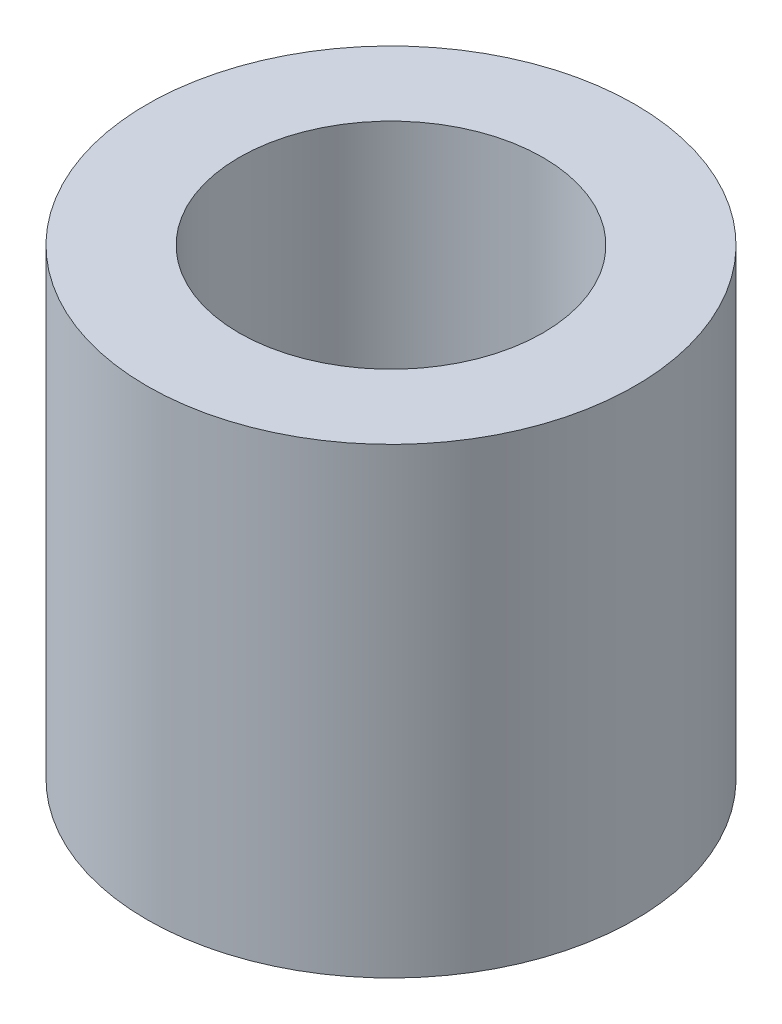
ISO-10303-21;
HEADER;
FILE_DESCRIPTION(('STEP AP214'),'2;1');
FILE_NAME('part.step','',(''),(''),'','','');
FILE_SCHEMA(('AUTOMOTIVE_DESIGN { 1 0 10303 214 1 1 1 1 }'));
ENDSEC;
DATA;
#1=APPLICATION_CONTEXT('core data for automotive mechanical design processes');
#2=APPLICATION_PROTOCOL_DEFINITION('international standard','automotive_design',2000,#1);
#3=PRODUCT_CONTEXT('',#1,'mechanical');
#4=PRODUCT('Part','Part','',(#3));
#5=PRODUCT_RELATED_PRODUCT_CATEGORY('part','',(#4));
#6=PRODUCT_DEFINITION_FORMATION('','',#4);
#7=PRODUCT_DEFINITION_CONTEXT('part definition',#1,'design');
#8=PRODUCT_DEFINITION('design','',#6,#7);
#9=PRODUCT_DEFINITION_SHAPE('','',#8);
#10=(LENGTH_UNIT() NAMED_UNIT(*) SI_UNIT(.MILLI.,.METRE.));
#11=(NAMED_UNIT(*) PLANE_ANGLE_UNIT() SI_UNIT($,.RADIAN.));
#12=(NAMED_UNIT(*) SI_UNIT($,.STERADIAN.) SOLID_ANGLE_UNIT());
#13=UNCERTAINTY_MEASURE_WITH_UNIT(LENGTH_MEASURE(1.E-05),#10,'distance_accuracy_value','');
#14=(GEOMETRIC_REPRESENTATION_CONTEXT(3) GLOBAL_UNCERTAINTY_ASSIGNED_CONTEXT((#13)) GLOBAL_UNIT_ASSIGNED_CONTEXT((#10,
#11,#12)) REPRESENTATION_CONTEXT('',''));
#15=CARTESIAN_POINT('',(0.,0.,0.));
#16=DIRECTION('',(0.,0.,1.));
#17=DIRECTION('',(1.,0.,0.));
#18=AXIS2_PLACEMENT_3D('',#15,#16,#17);
#19=CARTESIAN_POINT('',(0.,18.9408800495931,0.));
#20=DIRECTION('',(0.,-1.,0.));
#21=DIRECTION('',(0.,0.,-1.));
#22=AXIS2_PLACEMENT_3D('',#19,#20,#21);
#23=CYLINDRICAL_SURFACE('',#22,10.);
#24=CARTESIAN_POINT('',(0.,18.9408800495931,0.));
#25=DIRECTION('',(0.,1.,0.));
#26=DIRECTION('',(0.,0.,1.));
#27=AXIS2_PLACEMENT_3D('',#24,#25,#26);
#28=CIRCLE('',#27,10.);
#29=CARTESIAN_POINT('',(0.,18.9408800495931,10.));
#30=VERTEX_POINT('',#29);
#31=EDGE_CURVE('E10',#30,#30,#28,.T.);
#32=ORIENTED_EDGE('',*,*,#31,.F.);
#33=EDGE_LOOP('',(#32));
#34=FACE_BOUND('',#33,.T.);
#35=CARTESIAN_POINT('',(0.,0.,0.));
#36=DIRECTION('',(0.,1.,0.));
#37=DIRECTION('',(0.,0.,1.));
#38=AXIS2_PLACEMENT_3D('',#35,#36,#37);
#39=CIRCLE('',#38,10.);
#40=CARTESIAN_POINT('',(0.,0.,10.));
#41=VERTEX_POINT('',#40);
#42=EDGE_CURVE('E37',#41,#41,#39,.T.);
#43=ORIENTED_EDGE('',*,*,#42,.T.);
#44=EDGE_LOOP('',(#43));
#45=FACE_BOUND('',#44,.T.);
#46=ADVANCED_FACE('F40',(#34,#45),#23,.T.);
#47=CARTESIAN_POINT('',(0.,18.9408800495931,0.));
#48=DIRECTION('',(0.,1.,0.));
#49=DIRECTION('',(0.,0.,1.));
#50=AXIS2_PLACEMENT_3D('',#47,#48,#49);
#51=PLANE('',#50);
#52=CARTESIAN_POINT('',(0.,18.9408800495931,0.));
#53=DIRECTION('',(0.,1.,0.));
#54=DIRECTION('',(0.,0.,1.));
#55=AXIS2_PLACEMENT_3D('',#52,#53,#54);
#56=CIRCLE('',#55,6.22887569132874);
#57=CARTESIAN_POINT('',(0.,18.9408800495931,6.22887569132874));
#58=VERTEX_POINT('',#57);
#59=EDGE_CURVE('E50',#58,#58,#56,.T.);
#60=ORIENTED_EDGE('',*,*,#59,.F.);
#61=EDGE_LOOP('',(#60));
#62=FACE_BOUND('',#61,.T.);
#63=ORIENTED_EDGE('',*,*,#31,.T.);
#64=EDGE_LOOP('',(#63));
#65=FACE_BOUND('',#64,.T.);
#66=ADVANCED_FACE('F59',(#62,#65),#51,.T.);
#67=CARTESIAN_POINT('',(0.,0.,0.));
#68=DIRECTION('',(0.,1.,0.));
#69=DIRECTION('',(0.,0.,1.));
#70=AXIS2_PLACEMENT_3D('',#67,#68,#69);
#71=PLANE('',#70);
#72=CARTESIAN_POINT('',(0.,0.,0.));
#73=DIRECTION('',(0.,1.,0.));
#74=DIRECTION('',(0.,0.,1.));
#75=AXIS2_PLACEMENT_3D('',#72,#73,#74);
#76=CIRCLE('',#75,6.22887569132874);
#77=CARTESIAN_POINT('',(0.,0.,6.22887569132874));
#78=VERTEX_POINT('',#77);
#79=EDGE_CURVE('E47',#78,#78,#76,.T.);
#80=ORIENTED_EDGE('',*,*,#79,.T.);
#81=EDGE_LOOP('',(#80));
#82=FACE_BOUND('',#81,.T.);
#83=ORIENTED_EDGE('',*,*,#42,.F.);
#84=EDGE_LOOP('',(#83));
#85=FACE_BOUND('',#84,.T.);
#86=ADVANCED_FACE('F58',(#82,#85),#71,.F.);
#87=CARTESIAN_POINT('',(0.,18.9408800495931,0.));
#88=DIRECTION('',(0.,-1.,0.));
#89=DIRECTION('',(0.,0.,-1.));
#90=AXIS2_PLACEMENT_3D('',#87,#88,#89);
#91=CYLINDRICAL_SURFACE('',#90,6.22887569132874);
#92=ORIENTED_EDGE('',*,*,#59,.T.);
#93=EDGE_LOOP('',(#92));
#94=FACE_BOUND('',#93,.T.);
#95=ORIENTED_EDGE('',*,*,#79,.F.);
#96=EDGE_LOOP('',(#95));
#97=FACE_BOUND('',#96,.T.);
#98=ADVANCED_FACE('F54',(#94,#97),#91,.F.);
#99=CLOSED_SHELL('',(#46,#66,#86,#98));
#100=MANIFOLD_SOLID_BREP('B2',#99);
#101=ADVANCED_BREP_SHAPE_REPRESENTATION('',(#18,#100),#14);
#102=SHAPE_DEFINITION_REPRESENTATION(#9,#101);
ENDSEC;
END-ISO-10303-21;
